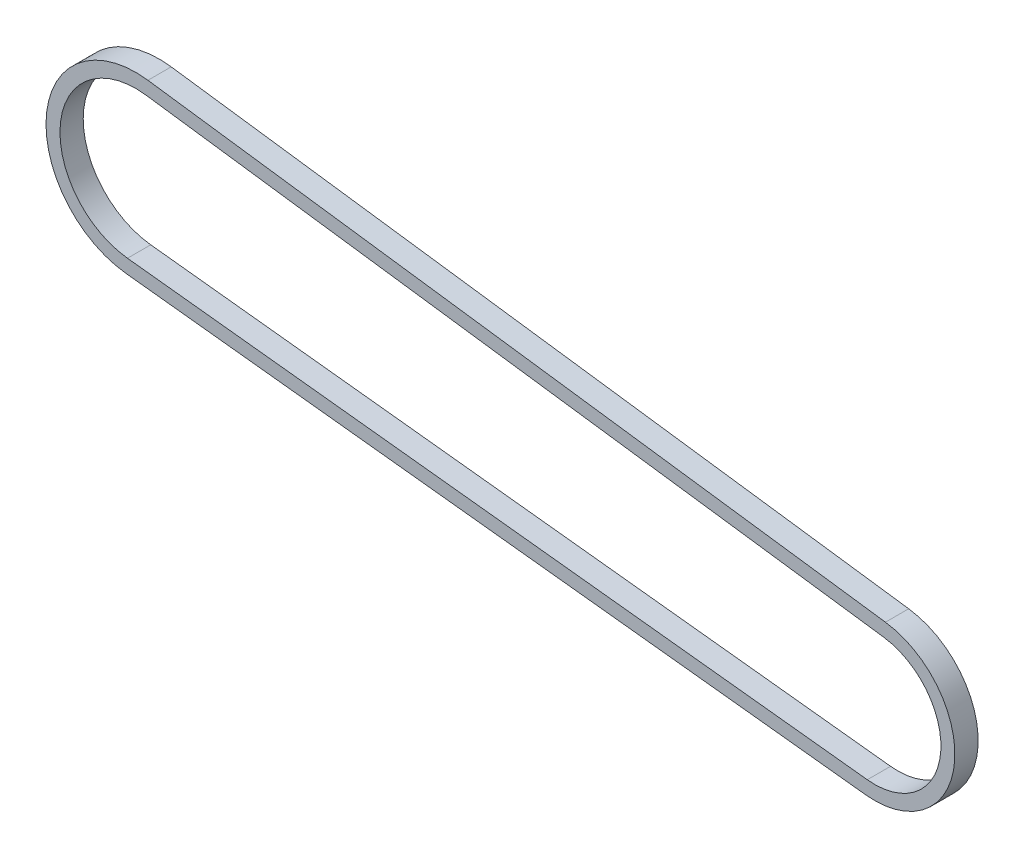
ISO-10303-21;
HEADER;
FILE_DESCRIPTION(('STEP AP214'),'2;1');
FILE_NAME('part.step','',(''),(''),'','','');
FILE_SCHEMA(('AUTOMOTIVE_DESIGN { 1 0 10303 214 1 1 1 1 }'));
ENDSEC;
DATA;
#1=APPLICATION_CONTEXT('core data for automotive mechanical design processes');
#2=APPLICATION_PROTOCOL_DEFINITION('international standard','automotive_design',2000,#1);
#3=PRODUCT_CONTEXT('',#1,'mechanical');
#4=PRODUCT('Part','Part','',(#3));
#5=PRODUCT_RELATED_PRODUCT_CATEGORY('part','',(#4));
#6=PRODUCT_DEFINITION_FORMATION('','',#4);
#7=PRODUCT_DEFINITION_CONTEXT('part definition',#1,'design');
#8=PRODUCT_DEFINITION('design','',#6,#7);
#9=PRODUCT_DEFINITION_SHAPE('','',#8);
#10=(LENGTH_UNIT() NAMED_UNIT(*) SI_UNIT(.MILLI.,.METRE.));
#11=(NAMED_UNIT(*) PLANE_ANGLE_UNIT() SI_UNIT($,.RADIAN.));
#12=(NAMED_UNIT(*) SI_UNIT($,.STERADIAN.) SOLID_ANGLE_UNIT());
#13=UNCERTAINTY_MEASURE_WITH_UNIT(LENGTH_MEASURE(1.E-05),#10,'distance_accuracy_value','');
#14=(GEOMETRIC_REPRESENTATION_CONTEXT(3) GLOBAL_UNCERTAINTY_ASSIGNED_CONTEXT((#13)) GLOBAL_UNIT_ASSIGNED_CONTEXT((#10,
#11,#12)) REPRESENTATION_CONTEXT('',''));
#15=CARTESIAN_POINT('',(0.,0.,0.));
#16=DIRECTION('',(0.,0.,1.));
#17=DIRECTION('',(1.,0.,0.));
#18=AXIS2_PLACEMENT_3D('',#15,#16,#17);
#19=CARTESIAN_POINT('',(-100.835337638316,12.4416511511481,3.17499999999998));
#20=DIRECTION('',(0.,0.,1.));
#21=DIRECTION('',(1.,0.,0.));
#22=AXIS2_PLACEMENT_3D('',#19,#20,#21);
#23=PLANE('',#22);
#24=CARTESIAN_POINT('',(-100.835337638316,12.4416511511481,3.17499999999998));
#25=DIRECTION('',(0.,0.,1.));
#26=DIRECTION('',(1.,0.,0.));
#27=AXIS2_PLACEMENT_3D('',#24,#25,#26);
#28=CIRCLE('',#27,12.2555);
#29=CARTESIAN_POINT('',(-99.1796038597839,24.5847901977303,3.17499999999998));
#30=VERTEX_POINT('',#29);
#31=CARTESIAN_POINT('',(-102.180908220482,0.260242363228344,3.17500000000004));
#32=VERTEX_POINT('',#31);
#33=EDGE_CURVE('E135',#30,#32,#28,.T.);
#34=ORIENTED_EDGE('',*,*,#33,.T.);
#35=DIRECTION('',(0.993954452117001,-0.109793201596455,0.));
#36=VECTOR('',#35,1.);
#37=CARTESIAN_POINT('',(-102.180908220482,0.260242363228344,3.17500000000004));
#38=LINE('',#37,#36);
#39=CARTESIAN_POINT('',(-1.20334446881731,-10.8938401906473,3.17500000000004));
#40=VERTEX_POINT('',#39);
#41=EDGE_CURVE('E138',#32,#40,#38,.T.);
#42=ORIENTED_EDGE('',*,*,#41,.T.);
#43=CARTESIAN_POINT('',(0.,1.52655665885959E-13,3.17499999999998));
#44=DIRECTION('',(0.,0.,1.));
#45=DIRECTION('',(-1.,0.,0.));
#46=AXIS2_PLACEMENT_3D('',#43,#44,#45);
#47=CIRCLE('',#46,10.9601);
#48=CARTESIAN_POINT('',(1.48072357603451,10.8596155411404,3.17499999999998));
#49=VERTEX_POINT('',#48);
#50=EDGE_CURVE('E141',#40,#49,#47,.T.);
#51=ORIENTED_EDGE('',*,*,#50,.T.);
#52=DIRECTION('',(-0.990831793609576,0.135101283385599,0.));
#53=VECTOR('',#52,1.);
#54=CARTESIAN_POINT('',(-99.1796038597839,24.5847901977303,3.17499999999998));
#55=LINE('',#54,#53);
#56=EDGE_CURVE('E143',#49,#30,#55,.T.);
#57=ORIENTED_EDGE('',*,*,#56,.T.);
#58=EDGE_LOOP('',(#34,#42,#51,#57));
#59=FACE_BOUND('',#58,.T.);
#60=DIRECTION('',(-0.990831793609576,0.135101283385599,0.));
#61=VECTOR('',#60,1.);
#62=CARTESIAN_POINT('',(-99.4369718046334,22.6972556309041,3.17499999999998));
#63=LINE('',#62,#61);
#64=CARTESIAN_POINT('',(1.22335563118494,8.97208097431432,3.17499999999998));
#65=VERTEX_POINT('',#64);
#66=CARTESIAN_POINT('',(-99.4369718046334,22.6972556309041,3.17499999999998));
#67=VERTEX_POINT('',#66);
#68=EDGE_CURVE('E107',#65,#67,#63,.T.);
#69=ORIENTED_EDGE('',*,*,#68,.F.);
#70=CARTESIAN_POINT('',(0.,1.52655665885959E-13,3.17499999999998));
#71=DIRECTION('',(0.,0.,1.));
#72=DIRECTION('',(-1.,0.,0.));
#73=AXIS2_PLACEMENT_3D('',#70,#71,#72);
#74=CIRCLE('',#73,9.0551);
#75=CARTESIAN_POINT('',(-0.994188419776078,-9.00035695936463,3.17500000000004));
#76=VERTEX_POINT('',#75);
#77=EDGE_CURVE('E99',#76,#65,#74,.T.);
#78=ORIENTED_EDGE('',*,*,#77,.F.);
#79=DIRECTION('',(0.993954452117001,-0.109793201596455,0.));
#80=VECTOR('',#79,1.);
#81=CARTESIAN_POINT('',(-101.97175217144,2.15372559451126,3.17499999999998));
#82=LINE('',#81,#80);
#83=CARTESIAN_POINT('',(-101.97175217144,2.15372559451127,3.17499999999998));
#84=VERTEX_POINT('',#83);
#85=EDGE_CURVE('E121',#84,#76,#82,.T.);
#86=ORIENTED_EDGE('',*,*,#85,.F.);
#87=CARTESIAN_POINT('',(-100.835337638316,12.4416511511481,3.17499999999998));
#88=DIRECTION('',(0.,0.,1.));
#89=DIRECTION('',(1.,0.,0.));
#90=AXIS2_PLACEMENT_3D('',#87,#88,#89);
#91=CIRCLE('',#90,10.3505);
#92=EDGE_CURVE('E119',#67,#84,#91,.T.);
#93=ORIENTED_EDGE('',*,*,#92,.F.);
#94=EDGE_LOOP('',(#69,#78,#86,#93));
#95=FACE_BOUND('',#94,.T.);
#96=ADVANCED_FACE('F34',(#59,#95),#23,.T.);
#97=CARTESIAN_POINT('',(-100.835337638316,12.4416511511481,0.));
#98=DIRECTION('',(0.,0.,1.));
#99=DIRECTION('',(1.,0.,0.));
#100=AXIS2_PLACEMENT_3D('',#97,#98,#99);
#101=PLANE('',#100);
#102=CARTESIAN_POINT('',(-100.835337638316,12.4416511511481,0.));
#103=DIRECTION('',(0.,0.,1.));
#104=DIRECTION('',(1.,0.,0.));
#105=AXIS2_PLACEMENT_3D('',#102,#103,#104);
#106=CIRCLE('',#105,12.2555);
#107=CARTESIAN_POINT('',(-99.1796038597839,24.5847901977302,0.));
#108=VERTEX_POINT('',#107);
#109=CARTESIAN_POINT('',(-102.180908220481,0.260242363228205,0.));
#110=VERTEX_POINT('',#109);
#111=EDGE_CURVE('E115',#108,#110,#106,.T.);
#112=ORIENTED_EDGE('',*,*,#111,.F.);
#113=DIRECTION('',(-0.990831793609576,0.135101283385599,0.));
#114=VECTOR('',#113,1.);
#115=CARTESIAN_POINT('',(-99.1796038597839,24.5847901977302,0.));
#116=LINE('',#115,#114);
#117=CARTESIAN_POINT('',(1.48072357603451,10.8596155411403,0.));
#118=VERTEX_POINT('',#117);
#119=EDGE_CURVE('E139',#118,#108,#116,.T.);
#120=ORIENTED_EDGE('',*,*,#119,.F.);
#121=CARTESIAN_POINT('',(0.,0.,0.));
#122=DIRECTION('',(0.,0.,1.));
#123=DIRECTION('',(-1.,0.,0.));
#124=AXIS2_PLACEMENT_3D('',#121,#122,#123);
#125=CIRCLE('',#124,10.9601);
#126=CARTESIAN_POINT('',(-1.20334446881729,-10.8938401906474,0.));
#127=VERTEX_POINT('',#126);
#128=EDGE_CURVE('E150',#127,#118,#125,.T.);
#129=ORIENTED_EDGE('',*,*,#128,.F.);
#130=DIRECTION('',(0.993954452117001,-0.109793201596455,0.));
#131=VECTOR('',#130,1.);
#132=CARTESIAN_POINT('',(-102.180908220481,0.260242363228205,0.));
#133=LINE('',#132,#131);
#134=EDGE_CURVE('E148',#110,#127,#133,.T.);
#135=ORIENTED_EDGE('',*,*,#134,.F.);
#136=EDGE_LOOP('',(#112,#120,#129,#135));
#137=FACE_BOUND('',#136,.T.);
#138=CARTESIAN_POINT('',(0.,0.,0.));
#139=DIRECTION('',(0.,0.,1.));
#140=DIRECTION('',(-1.,0.,0.));
#141=AXIS2_PLACEMENT_3D('',#138,#139,#140);
#142=CIRCLE('',#141,9.0551);
#143=CARTESIAN_POINT('',(-0.99418841977606,-9.00035695936477,0.));
#144=VERTEX_POINT('',#143);
#145=CARTESIAN_POINT('',(1.22335563118494,8.97208097431421,0.));
#146=VERTEX_POINT('',#145);
#147=EDGE_CURVE('E57',#144,#146,#142,.T.);
#148=ORIENTED_EDGE('',*,*,#147,.T.);
#149=DIRECTION('',(-0.990831793609576,0.135101283385599,0.));
#150=VECTOR('',#149,1.);
#151=CARTESIAN_POINT('',(-99.4369718046334,22.697255630904,0.));
#152=LINE('',#151,#150);
#153=CARTESIAN_POINT('',(-99.4369718046334,22.697255630904,0.));
#154=VERTEX_POINT('',#153);
#155=EDGE_CURVE('E114',#146,#154,#152,.T.);
#156=ORIENTED_EDGE('',*,*,#155,.T.);
#157=CARTESIAN_POINT('',(-100.835337638316,12.4416511511481,0.));
#158=DIRECTION('',(0.,0.,1.));
#159=DIRECTION('',(1.,0.,0.));
#160=AXIS2_PLACEMENT_3D('',#157,#158,#159);
#161=CIRCLE('',#160,10.3505);
#162=CARTESIAN_POINT('',(-101.97175217144,2.15372559451113,0.));
#163=VERTEX_POINT('',#162);
#164=EDGE_CURVE('E127',#154,#163,#161,.T.);
#165=ORIENTED_EDGE('',*,*,#164,.T.);
#166=DIRECTION('',(0.993954452117001,-0.109793201596455,0.));
#167=VECTOR('',#166,1.);
#168=CARTESIAN_POINT('',(-101.97175217144,2.15372559451112,0.));
#169=LINE('',#168,#167);
#170=EDGE_CURVE('E108',#163,#144,#169,.T.);
#171=ORIENTED_EDGE('',*,*,#170,.T.);
#172=EDGE_LOOP('',(#148,#156,#165,#171));
#173=FACE_BOUND('',#172,.T.);
#174=ADVANCED_FACE('F168',(#137,#173),#101,.F.);
#175=CARTESIAN_POINT('',(-100.835337638316,12.4416511511481,3.17499999999998));
#176=DIRECTION('',(0.,0.,-1.));
#177=DIRECTION('',(-1.,0.,0.));
#178=AXIS2_PLACEMENT_3D('',#175,#176,#177);
#179=CYLINDRICAL_SURFACE('',#178,12.2555);
#180=ORIENTED_EDGE('',*,*,#111,.T.);
#181=DIRECTION('',(0.,0.,-1.));
#182=VECTOR('',#181,1.);
#183=CARTESIAN_POINT('',(-102.180908220482,0.260242363228344,3.17500000000004));
#184=LINE('',#183,#182);
#185=EDGE_CURVE('E11',#32,#110,#184,.T.);
#186=ORIENTED_EDGE('',*,*,#185,.F.);
#187=ORIENTED_EDGE('',*,*,#33,.F.);
#188=DIRECTION('',(0.,0.,-1.));
#189=VECTOR('',#188,1.);
#190=CARTESIAN_POINT('',(-99.1796038597839,24.5847901977303,3.17499999999998));
#191=LINE('',#190,#189);
#192=EDGE_CURVE('E145',#30,#108,#191,.T.);
#193=ORIENTED_EDGE('',*,*,#192,.T.);
#194=EDGE_LOOP('',(#180,#186,#187,#193));
#195=FACE_BOUND('',#194,.T.);
#196=ADVANCED_FACE('F36',(#195),#179,.T.);
#197=CARTESIAN_POINT('',(-102.180908220482,0.260242363228344,3.17500000000004));
#198=DIRECTION('',(0.109793201596455,0.993954452117001,0.));
#199=DIRECTION('',(-0.993954452117001,0.109793201596455,0.));
#200=AXIS2_PLACEMENT_3D('',#197,#198,#199);
#201=PLANE('',#200);
#202=ORIENTED_EDGE('',*,*,#134,.T.);
#203=DIRECTION('',(0.,0.,-1.));
#204=VECTOR('',#203,1.);
#205=CARTESIAN_POINT('',(-1.20334446881731,-10.8938401906473,3.17500000000004));
#206=LINE('',#205,#204);
#207=EDGE_CURVE('E42',#40,#127,#206,.T.);
#208=ORIENTED_EDGE('',*,*,#207,.F.);
#209=ORIENTED_EDGE('',*,*,#41,.F.);
#210=ORIENTED_EDGE('',*,*,#185,.T.);
#211=EDGE_LOOP('',(#202,#208,#209,#210));
#212=FACE_BOUND('',#211,.T.);
#213=ADVANCED_FACE('F178',(#212),#201,.F.);
#214=CARTESIAN_POINT('',(0.,1.52655665885959E-13,3.17499999999998));
#215=DIRECTION('',(0.,0.,-1.));
#216=DIRECTION('',(-1.,0.,0.));
#217=AXIS2_PLACEMENT_3D('',#214,#215,#216);
#218=CYLINDRICAL_SURFACE('',#217,10.9601);
#219=ORIENTED_EDGE('',*,*,#128,.T.);
#220=DIRECTION('',(0.,0.,-1.));
#221=VECTOR('',#220,1.);
#222=CARTESIAN_POINT('',(1.48072357603451,10.8596155411404,3.17499999999998));
#223=LINE('',#222,#221);
#224=EDGE_CURVE('E155',#49,#118,#223,.T.);
#225=ORIENTED_EDGE('',*,*,#224,.F.);
#226=ORIENTED_EDGE('',*,*,#50,.F.);
#227=ORIENTED_EDGE('',*,*,#207,.T.);
#228=EDGE_LOOP('',(#219,#225,#226,#227));
#229=FACE_BOUND('',#228,.T.);
#230=ADVANCED_FACE('F162',(#229),#218,.T.);
#231=CARTESIAN_POINT('',(-99.1796038597839,24.5847901977303,3.17499999999998));
#232=DIRECTION('',(-0.135101283385599,-0.990831793609576,0.));
#233=DIRECTION('',(0.990831793609576,-0.135101283385599,0.));
#234=AXIS2_PLACEMENT_3D('',#231,#232,#233);
#235=PLANE('',#234);
#236=ORIENTED_EDGE('',*,*,#119,.T.);
#237=ORIENTED_EDGE('',*,*,#192,.F.);
#238=ORIENTED_EDGE('',*,*,#56,.F.);
#239=ORIENTED_EDGE('',*,*,#224,.T.);
#240=EDGE_LOOP('',(#236,#237,#238,#239));
#241=FACE_BOUND('',#240,.T.);
#242=ADVANCED_FACE('F172',(#241),#235,.F.);
#243=CARTESIAN_POINT('',(0.,1.52655665885959E-13,3.17499999999998));
#244=DIRECTION('',(0.,0.,-1.));
#245=DIRECTION('',(-1.,0.,0.));
#246=AXIS2_PLACEMENT_3D('',#243,#244,#245);
#247=CYLINDRICAL_SURFACE('',#246,9.0551);
#248=ORIENTED_EDGE('',*,*,#147,.F.);
#249=DIRECTION('',(0.,0.,-1.));
#250=VECTOR('',#249,1.);
#251=CARTESIAN_POINT('',(-0.994188419776078,-9.00035695936463,3.17500000000004));
#252=LINE('',#251,#250);
#253=EDGE_CURVE('E103',#76,#144,#252,.T.);
#254=ORIENTED_EDGE('',*,*,#253,.F.);
#255=ORIENTED_EDGE('',*,*,#77,.T.);
#256=DIRECTION('',(0.,0.,-1.));
#257=VECTOR('',#256,1.);
#258=CARTESIAN_POINT('',(1.22335563118494,8.97208097431432,3.17499999999998));
#259=LINE('',#258,#257);
#260=EDGE_CURVE('E102',#65,#146,#259,.T.);
#261=ORIENTED_EDGE('',*,*,#260,.T.);
#262=EDGE_LOOP('',(#248,#254,#255,#261));
#263=FACE_BOUND('',#262,.T.);
#264=ADVANCED_FACE('F101',(#263),#247,.F.);
#265=CARTESIAN_POINT('',(-99.4369718046334,22.6972556309041,3.17499999999998));
#266=DIRECTION('',(-0.135101283385599,-0.990831793609576,0.));
#267=DIRECTION('',(0.990831793609576,-0.135101283385599,0.));
#268=AXIS2_PLACEMENT_3D('',#265,#266,#267);
#269=PLANE('',#268);
#270=ORIENTED_EDGE('',*,*,#155,.F.);
#271=ORIENTED_EDGE('',*,*,#260,.F.);
#272=ORIENTED_EDGE('',*,*,#68,.T.);
#273=DIRECTION('',(0.,0.,-1.));
#274=VECTOR('',#273,1.);
#275=CARTESIAN_POINT('',(-99.4369718046334,22.6972556309041,3.17499999999998));
#276=LINE('',#275,#274);
#277=EDGE_CURVE('E116',#67,#154,#276,.T.);
#278=ORIENTED_EDGE('',*,*,#277,.T.);
#279=EDGE_LOOP('',(#270,#271,#272,#278));
#280=FACE_BOUND('',#279,.T.);
#281=ADVANCED_FACE('F111',(#280),#269,.T.);
#282=CARTESIAN_POINT('',(-100.835337638316,12.4416511511481,3.17499999999998));
#283=DIRECTION('',(0.,0.,-1.));
#284=DIRECTION('',(-1.,0.,0.));
#285=AXIS2_PLACEMENT_3D('',#282,#283,#284);
#286=CYLINDRICAL_SURFACE('',#285,10.3505);
#287=ORIENTED_EDGE('',*,*,#164,.F.);
#288=ORIENTED_EDGE('',*,*,#277,.F.);
#289=ORIENTED_EDGE('',*,*,#92,.T.);
#290=DIRECTION('',(0.,0.,-1.));
#291=VECTOR('',#290,1.);
#292=CARTESIAN_POINT('',(-101.97175217144,2.15372559451127,3.17499999999998));
#293=LINE('',#292,#291);
#294=EDGE_CURVE('E49',#84,#163,#293,.T.);
#295=ORIENTED_EDGE('',*,*,#294,.T.);
#296=EDGE_LOOP('',(#287,#288,#289,#295));
#297=FACE_BOUND('',#296,.T.);
#298=ADVANCED_FACE('F201',(#297),#286,.F.);
#299=CARTESIAN_POINT('',(-101.97175217144,2.15372559451126,3.17499999999998));
#300=DIRECTION('',(0.109793201596455,0.993954452117001,0.));
#301=DIRECTION('',(-0.993954452117001,0.109793201596455,0.));
#302=AXIS2_PLACEMENT_3D('',#299,#300,#301);
#303=PLANE('',#302);
#304=ORIENTED_EDGE('',*,*,#170,.F.);
#305=ORIENTED_EDGE('',*,*,#294,.F.);
#306=ORIENTED_EDGE('',*,*,#85,.T.);
#307=ORIENTED_EDGE('',*,*,#253,.T.);
#308=EDGE_LOOP('',(#304,#305,#306,#307));
#309=FACE_BOUND('',#308,.T.);
#310=ADVANCED_FACE('F205',(#309),#303,.T.);
#311=CLOSED_SHELL('',(#96,#174,#196,#213,#230,#242,#264,#281,#298,#310));
#312=MANIFOLD_SOLID_BREP('B2',#311);
#313=ADVANCED_BREP_SHAPE_REPRESENTATION('',(#18,#312),#14);
#314=SHAPE_DEFINITION_REPRESENTATION(#9,#313);
ENDSEC;
END-ISO-10303-21;
